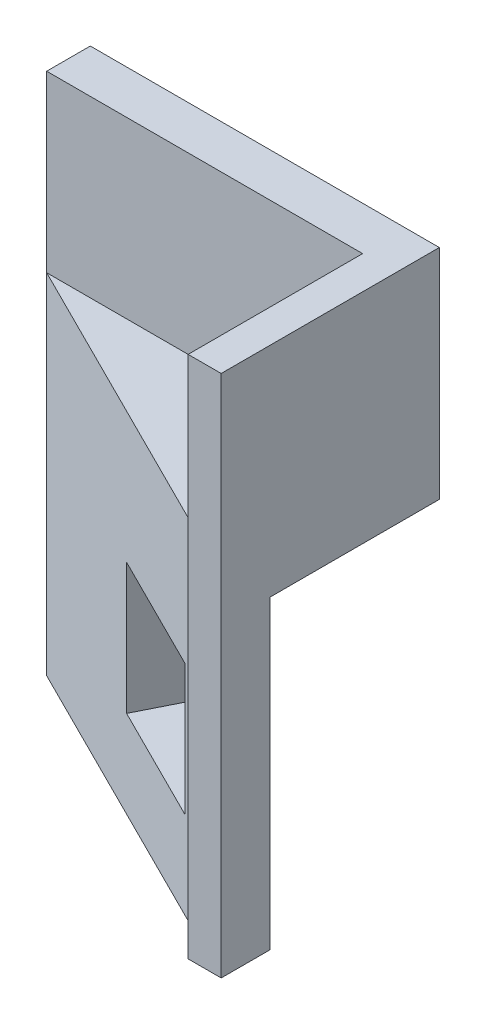
ISO-10303-21;
HEADER;
FILE_DESCRIPTION(('STEP AP214'),'2;1');
FILE_NAME('part.step','',(''),(''),'','','');
FILE_SCHEMA(('AUTOMOTIVE_DESIGN { 1 0 10303 214 1 1 1 1 }'));
ENDSEC;
DATA;
#1=APPLICATION_CONTEXT('core data for automotive mechanical design processes');
#2=APPLICATION_PROTOCOL_DEFINITION('international standard','automotive_design',2000,#1);
#3=PRODUCT_CONTEXT('',#1,'mechanical');
#4=PRODUCT('Part','Part','',(#3));
#5=PRODUCT_RELATED_PRODUCT_CATEGORY('part','',(#4));
#6=PRODUCT_DEFINITION_FORMATION('','',#4);
#7=PRODUCT_DEFINITION_CONTEXT('part definition',#1,'design');
#8=PRODUCT_DEFINITION('design','',#6,#7);
#9=PRODUCT_DEFINITION_SHAPE('','',#8);
#10=(LENGTH_UNIT() NAMED_UNIT(*) SI_UNIT(.MILLI.,.METRE.));
#11=(NAMED_UNIT(*) PLANE_ANGLE_UNIT() SI_UNIT($,.RADIAN.));
#12=(NAMED_UNIT(*) SI_UNIT($,.STERADIAN.) SOLID_ANGLE_UNIT());
#13=UNCERTAINTY_MEASURE_WITH_UNIT(LENGTH_MEASURE(1.E-05),#10,'distance_accuracy_value','');
#14=(GEOMETRIC_REPRESENTATION_CONTEXT(3) GLOBAL_UNCERTAINTY_ASSIGNED_CONTEXT((#13)) GLOBAL_UNIT_ASSIGNED_CONTEXT((#10,
#11,#12)) REPRESENTATION_CONTEXT('',''));
#15=CARTESIAN_POINT('',(0.,0.,0.));
#16=DIRECTION('',(0.,0.,1.));
#17=DIRECTION('',(1.,0.,0.));
#18=AXIS2_PLACEMENT_3D('',#15,#16,#17);
#19=CARTESIAN_POINT('',(0.,0.,6.35));
#20=DIRECTION('',(1.,0.,0.));
#21=DIRECTION('',(0.,1.,0.));
#22=AXIS2_PLACEMENT_3D('',#19,#20,#21);
#23=PLANE('',#22);
#24=DIRECTION('',(0.,0.,-1.));
#25=VECTOR('',#24,1.);
#26=CARTESIAN_POINT('',(0.,-76.2,6.35));
#27=LINE('',#26,#25);
#28=CARTESIAN_POINT('',(0.,-76.2,6.35));
#29=VERTEX_POINT('',#28);
#30=CARTESIAN_POINT('',(0.,-76.2,0.));
#31=VERTEX_POINT('',#30);
#32=EDGE_CURVE('E44',#29,#31,#27,.T.);
#33=ORIENTED_EDGE('',*,*,#32,.F.);
#34=DIRECTION('',(0.,1.,0.));
#35=VECTOR('',#34,1.);
#36=CARTESIAN_POINT('',(0.,-76.201,6.35));
#37=LINE('',#36,#35);
#38=CARTESIAN_POINT('',(0.,-25.4,6.35));
#39=VERTEX_POINT('',#38);
#40=EDGE_CURVE('E221',#29,#39,#37,.T.);
#41=ORIENTED_EDGE('',*,*,#40,.T.);
#42=DIRECTION('',(0.,-1.,0.));
#43=VECTOR('',#42,1.);
#44=CARTESIAN_POINT('',(0.,0.,6.35));
#45=LINE('',#44,#43);
#46=CARTESIAN_POINT('',(0.,0.,6.35));
#47=VERTEX_POINT('',#46);
#48=EDGE_CURVE('E215',#47,#39,#45,.T.);
#49=ORIENTED_EDGE('',*,*,#48,.F.);
#50=DIRECTION('',(0.,0.,-1.));
#51=VECTOR('',#50,1.);
#52=CARTESIAN_POINT('',(0.,0.,6.35));
#53=LINE('',#52,#51);
#54=CARTESIAN_POINT('',(0.,0.,0.));
#55=VERTEX_POINT('',#54);
#56=EDGE_CURVE('E247',#47,#55,#53,.T.);
#57=ORIENTED_EDGE('',*,*,#56,.T.);
#58=DIRECTION('',(0.,-1.,0.));
#59=VECTOR('',#58,1.);
#60=CARTESIAN_POINT('',(0.,0.,0.));
#61=LINE('',#60,#59);
#62=EDGE_CURVE('E207',#55,#31,#61,.T.);
#63=ORIENTED_EDGE('',*,*,#62,.T.);
#64=EDGE_LOOP('',(#33,#41,#49,#57,#63));
#65=FACE_BOUND('',#64,.T.);
#66=ADVANCED_FACE('F35',(#65),#23,.F.);
#67=CARTESIAN_POINT('',(0.,-76.2,6.35));
#68=DIRECTION('',(0.,1.,0.));
#69=DIRECTION('',(0.,0.,1.));
#70=AXIS2_PLACEMENT_3D('',#67,#68,#69);
#71=PLANE('',#70);
#72=DIRECTION('',(1.,0.,0.));
#73=VECTOR('',#72,1.);
#74=CARTESIAN_POINT('',(0.,-76.2,0.));
#75=LINE('',#74,#73);
#76=CARTESIAN_POINT('',(1.4990316571237,-76.2,0.));
#77=VERTEX_POINT('',#76);
#78=EDGE_CURVE('E267',#31,#77,#75,.T.);
#79=ORIENTED_EDGE('',*,*,#78,.T.);
#80=DIRECTION('',(-0.894427190999916,0.,-0.447213595499958));
#81=VECTOR('',#80,1.);
#82=CARTESIAN_POINT('',(50.8,-76.2,24.6504841714382));
#83=LINE('',#82,#81);
#84=CARTESIAN_POINT('',(50.8,-76.2,24.6504841714382));
#85=VERTEX_POINT('',#84);
#86=EDGE_CURVE('E147',#85,#77,#83,.T.);
#87=ORIENTED_EDGE('',*,*,#86,.F.);
#88=DIRECTION('',(0.,0.,-1.));
#89=VECTOR('',#88,1.);
#90=CARTESIAN_POINT('',(50.8,-76.2,6.35));
#91=LINE('',#90,#89);
#92=CARTESIAN_POINT('',(50.8,-76.2,31.75));
#93=VERTEX_POINT('',#92);
#94=EDGE_CURVE('E254',#93,#85,#91,.T.);
#95=ORIENTED_EDGE('',*,*,#94,.F.);
#96=DIRECTION('',(-1.,0.,0.));
#97=VECTOR('',#96,1.);
#98=CARTESIAN_POINT('',(50.8,-76.2,31.75));
#99=LINE('',#98,#97);
#100=CARTESIAN_POINT('',(45.9862967894864,-76.2,31.75));
#101=VERTEX_POINT('',#100);
#102=EDGE_CURVE('E181',#93,#101,#99,.T.);
#103=ORIENTED_EDGE('',*,*,#102,.T.);
#104=DIRECTION('',(0.,0.,-1.));
#105=VECTOR('',#104,1.);
#106=CARTESIAN_POINT('',(45.9862967894864,-76.2,31.75));
#107=LINE('',#106,#105);
#108=CARTESIAN_POINT('',(45.9862967894864,-76.2,29.3431483947432));
#109=VERTEX_POINT('',#108);
#110=EDGE_CURVE('E191',#101,#109,#107,.T.);
#111=ORIENTED_EDGE('',*,*,#110,.T.);
#112=DIRECTION('',(0.894427190999916,0.,0.447213595499958));
#113=VECTOR('',#112,1.);
#114=CARTESIAN_POINT('',(50.8,-76.2,31.75));
#115=LINE('',#114,#113);
#116=EDGE_CURVE('E202',#29,#109,#115,.T.);
#117=ORIENTED_EDGE('',*,*,#116,.F.);
#118=ORIENTED_EDGE('',*,*,#32,.T.);
#119=EDGE_LOOP('',(#79,#87,#95,#103,#111,#117,#118));
#120=FACE_BOUND('',#119,.T.);
#121=ADVANCED_FACE('F265',(#120),#71,.F.);
#122=CARTESIAN_POINT('',(50.8,0.,6.35));
#123=DIRECTION('',(-1.,0.,0.));
#124=DIRECTION('',(0.,-1.,0.));
#125=AXIS2_PLACEMENT_3D('',#122,#123,#124);
#126=PLANE('',#125);
#127=ORIENTED_EDGE('',*,*,#94,.T.);
#128=DIRECTION('',(0.,-1.,0.));
#129=VECTOR('',#128,1.);
#130=CARTESIAN_POINT('',(50.8,-31.75,24.6504841714382));
#131=LINE('',#130,#129);
#132=CARTESIAN_POINT('',(50.8,-31.75,24.6504841714382));
#133=VERTEX_POINT('',#132);
#134=EDGE_CURVE('E176',#133,#85,#131,.T.);
#135=ORIENTED_EDGE('',*,*,#134,.F.);
#136=DIRECTION('',(0.,0.,1.));
#137=VECTOR('',#136,1.);
#138=CARTESIAN_POINT('',(50.8,-31.75,0.));
#139=LINE('',#138,#137);
#140=CARTESIAN_POINT('',(50.8,-31.75,0.));
#141=VERTEX_POINT('',#140);
#142=EDGE_CURVE('E172',#141,#133,#139,.T.);
#143=ORIENTED_EDGE('',*,*,#142,.F.);
#144=DIRECTION('',(0.,1.,0.));
#145=VECTOR('',#144,1.);
#146=CARTESIAN_POINT('',(50.8,0.,0.));
#147=LINE('',#146,#145);
#148=CARTESIAN_POINT('',(50.8,0.,0.));
#149=VERTEX_POINT('',#148);
#150=EDGE_CURVE('E272',#141,#149,#147,.T.);
#151=ORIENTED_EDGE('',*,*,#150,.T.);
#152=DIRECTION('',(0.,0.,-1.));
#153=VECTOR('',#152,1.);
#154=CARTESIAN_POINT('',(50.8,0.,6.35));
#155=LINE('',#154,#153);
#156=CARTESIAN_POINT('',(50.8,0.,31.75));
#157=VERTEX_POINT('',#156);
#158=EDGE_CURVE('E252',#157,#149,#155,.T.);
#159=ORIENTED_EDGE('',*,*,#158,.F.);
#160=DIRECTION('',(0.,1.,0.));
#161=VECTOR('',#160,1.);
#162=CARTESIAN_POINT('',(50.8,-76.2,31.75));
#163=LINE('',#162,#161);
#164=EDGE_CURVE('E205',#93,#157,#163,.T.);
#165=ORIENTED_EDGE('',*,*,#164,.F.);
#166=EDGE_LOOP('',(#127,#135,#143,#151,#159,#165));
#167=FACE_BOUND('',#166,.T.);
#168=ADVANCED_FACE('F276',(#167),#126,.F.);
#169=CARTESIAN_POINT('',(0.,0.,6.35));
#170=DIRECTION('',(0.,-1.,0.));
#171=DIRECTION('',(0.,0.,-1.));
#172=AXIS2_PLACEMENT_3D('',#169,#170,#171);
#173=PLANE('',#172);
#174=DIRECTION('',(-1.,0.,0.));
#175=VECTOR('',#174,1.);
#176=CARTESIAN_POINT('',(0.,0.,6.35));
#177=LINE('',#176,#175);
#178=CARTESIAN_POINT('',(45.9862967894864,0.,6.35));
#179=VERTEX_POINT('',#178);
#180=EDGE_CURVE('E212',#179,#47,#177,.T.);
#181=ORIENTED_EDGE('',*,*,#180,.F.);
#182=DIRECTION('',(0.,0.,-1.));
#183=VECTOR('',#182,1.);
#184=CARTESIAN_POINT('',(45.9862967894864,0.,31.75));
#185=LINE('',#184,#183);
#186=CARTESIAN_POINT('',(45.9862967894864,0.,31.75));
#187=VERTEX_POINT('',#186);
#188=EDGE_CURVE('E192',#187,#179,#185,.T.);
#189=ORIENTED_EDGE('',*,*,#188,.F.);
#190=DIRECTION('',(1.,0.,0.));
#191=VECTOR('',#190,1.);
#192=CARTESIAN_POINT('',(50.8,0.,31.75));
#193=LINE('',#192,#191);
#194=EDGE_CURVE('E188',#187,#157,#193,.T.);
#195=ORIENTED_EDGE('',*,*,#194,.T.);
#196=ORIENTED_EDGE('',*,*,#158,.T.);
#197=DIRECTION('',(-1.,0.,0.));
#198=VECTOR('',#197,1.);
#199=CARTESIAN_POINT('',(0.,0.,0.));
#200=LINE('',#199,#198);
#201=EDGE_CURVE('E219',#149,#55,#200,.T.);
#202=ORIENTED_EDGE('',*,*,#201,.T.);
#203=ORIENTED_EDGE('',*,*,#56,.F.);
#204=EDGE_LOOP('',(#181,#189,#195,#196,#202,#203));
#205=FACE_BOUND('',#204,.T.);
#206=ADVANCED_FACE('F248',(#205),#173,.F.);
#207=CARTESIAN_POINT('',(0.,0.,6.35));
#208=DIRECTION('',(0.,0.,1.));
#209=DIRECTION('',(1.,0.,0.));
#210=AXIS2_PLACEMENT_3D('',#207,#208,#209);
#211=PLANE('',#210);
#212=DIRECTION('',(0.,-1.,0.));
#213=VECTOR('',#212,1.);
#214=CARTESIAN_POINT('',(45.9862967894864,0.,6.35));
#215=LINE('',#214,#213);
#216=CARTESIAN_POINT('',(45.9862967894864,-25.4,6.35));
#217=VERTEX_POINT('',#216);
#218=EDGE_CURVE('E199',#179,#217,#215,.T.);
#219=ORIENTED_EDGE('',*,*,#218,.F.);
#220=ORIENTED_EDGE('',*,*,#180,.T.);
#221=ORIENTED_EDGE('',*,*,#48,.T.);
#222=DIRECTION('',(-1.,0.,0.));
#223=VECTOR('',#222,1.);
#224=CARTESIAN_POINT('',(0.,-25.4,6.35));
#225=LINE('',#224,#223);
#226=EDGE_CURVE('E38',#217,#39,#225,.T.);
#227=ORIENTED_EDGE('',*,*,#226,.F.);
#228=EDGE_LOOP('',(#219,#220,#221,#227));
#229=FACE_BOUND('',#228,.T.);
#230=ADVANCED_FACE('F243',(#229),#211,.T.);
#231=CARTESIAN_POINT('',(0.,0.,0.));
#232=DIRECTION('',(0.,0.,1.));
#233=DIRECTION('',(1.,0.,0.));
#234=AXIS2_PLACEMENT_3D('',#231,#232,#233);
#235=PLANE('',#234);
#236=DIRECTION('',(1.,0.,0.));
#237=VECTOR('',#236,1.);
#238=CARTESIAN_POINT('',(1.4990316571237,-31.75,0.));
#239=LINE('',#238,#237);
#240=CARTESIAN_POINT('',(1.4990316571237,-31.75,0.));
#241=VERTEX_POINT('',#240);
#242=EDGE_CURVE('E170',#241,#141,#239,.T.);
#243=ORIENTED_EDGE('',*,*,#242,.F.);
#244=DIRECTION('',(0.,-1.,0.));
#245=VECTOR('',#244,1.);
#246=CARTESIAN_POINT('',(1.4990316571237,-31.75,0.));
#247=LINE('',#246,#245);
#248=EDGE_CURVE('E178',#241,#77,#247,.T.);
#249=ORIENTED_EDGE('',*,*,#248,.T.);
#250=ORIENTED_EDGE('',*,*,#78,.F.);
#251=ORIENTED_EDGE('',*,*,#62,.F.);
#252=ORIENTED_EDGE('',*,*,#201,.F.);
#253=ORIENTED_EDGE('',*,*,#150,.F.);
#254=EDGE_LOOP('',(#243,#249,#250,#251,#252,#253));
#255=FACE_BOUND('',#254,.T.);
#256=ADVANCED_FACE('F270',(#255),#235,.F.);
#257=CARTESIAN_POINT('',(0.,-25.4,31.75));
#258=DIRECTION('',(0.,-1.,0.));
#259=DIRECTION('',(0.,0.,-1.));
#260=AXIS2_PLACEMENT_3D('',#257,#258,#259);
#261=PLANE('',#260);
#262=DIRECTION('',(-0.894427190999916,0.,-0.447213595499958));
#263=VECTOR('',#262,1.);
#264=CARTESIAN_POINT('',(50.8,-25.4,31.75));
#265=LINE('',#264,#263);
#266=CARTESIAN_POINT('',(45.9862967894864,-25.4,29.3431483947432));
#267=VERTEX_POINT('',#266);
#268=EDGE_CURVE('E204',#267,#39,#265,.T.);
#269=ORIENTED_EDGE('',*,*,#268,.F.);
#270=DIRECTION('',(0.,0.,-1.));
#271=VECTOR('',#270,1.);
#272=CARTESIAN_POINT('',(45.9862967894864,-25.4,31.75));
#273=LINE('',#272,#271);
#274=EDGE_CURVE('E195',#267,#217,#273,.T.);
#275=ORIENTED_EDGE('',*,*,#274,.T.);
#276=ORIENTED_EDGE('',*,*,#226,.T.);
#277=EDGE_LOOP('',(#269,#275,#276));
#278=FACE_BOUND('',#277,.T.);
#279=ADVANCED_FACE('F307',(#278),#261,.F.);
#280=CARTESIAN_POINT('',(50.8,-76.201,31.75));
#281=DIRECTION('',(0.447213595499958,0.,-0.894427190999916));
#282=DIRECTION('',(-0.894427190999916,0.,-0.447213595499958));
#283=AXIS2_PLACEMENT_3D('',#280,#281,#282);
#284=PLANE('',#283);
#285=DIRECTION('',(0.894427190999916,0.,0.447213595499958));
#286=VECTOR('',#285,1.);
#287=CARTESIAN_POINT('',(23.2678461380885,-63.5,17.9839230690443));
#288=LINE('',#287,#286);
#289=CARTESIAN_POINT('',(23.2678461380885,-63.5,17.9839230690443));
#290=VERTEX_POINT('',#289);
#291=CARTESIAN_POINT('',(40.3066841266369,-63.5,26.5033420633185));
#292=VERTEX_POINT('',#291);
#293=EDGE_CURVE('E155',#290,#292,#288,.T.);
#294=ORIENTED_EDGE('',*,*,#293,.F.);
#295=DIRECTION('',(0.,-1.,0.));
#296=VECTOR('',#295,1.);
#297=CARTESIAN_POINT('',(23.2678461380885,-44.45,17.9839230690443));
#298=LINE('',#297,#296);
#299=CARTESIAN_POINT('',(23.2678461380885,-44.45,17.9839230690443));
#300=VERTEX_POINT('',#299);
#301=EDGE_CURVE('E51',#300,#290,#298,.T.);
#302=ORIENTED_EDGE('',*,*,#301,.F.);
#303=DIRECTION('',(-0.894427190999916,0.,-0.447213595499958));
#304=VECTOR('',#303,1.);
#305=CARTESIAN_POINT('',(23.2678461380885,-44.45,17.9839230690443));
#306=LINE('',#305,#304);
#307=CARTESIAN_POINT('',(40.3066841266369,-44.45,26.5033420633185));
#308=VERTEX_POINT('',#307);
#309=EDGE_CURVE('E141',#308,#300,#306,.T.);
#310=ORIENTED_EDGE('',*,*,#309,.F.);
#311=DIRECTION('',(0.,1.,0.));
#312=VECTOR('',#311,1.);
#313=CARTESIAN_POINT('',(40.3066841266369,-44.45,26.5033420633185));
#314=LINE('',#313,#312);
#315=EDGE_CURVE('E161',#292,#308,#314,.T.);
#316=ORIENTED_EDGE('',*,*,#315,.F.);
#317=EDGE_LOOP('',(#294,#302,#310,#316));
#318=FACE_BOUND('',#317,.T.);
#319=ORIENTED_EDGE('',*,*,#116,.T.);
#320=DIRECTION('',(0.,1.,0.));
#321=VECTOR('',#320,1.);
#322=CARTESIAN_POINT('',(45.9862967894864,-76.201,29.3431483947432));
#323=LINE('',#322,#321);
#324=EDGE_CURVE('E11',#109,#267,#323,.T.);
#325=ORIENTED_EDGE('',*,*,#324,.T.);
#326=ORIENTED_EDGE('',*,*,#268,.T.);
#327=ORIENTED_EDGE('',*,*,#40,.F.);
#328=EDGE_LOOP('',(#319,#325,#326,#327));
#329=FACE_BOUND('',#328,.T.);
#330=ADVANCED_FACE('F231',(#318,#329),#284,.F.);
#331=CARTESIAN_POINT('',(45.9862967894864,0.,31.75));
#332=DIRECTION('',(-1.,0.,0.));
#333=DIRECTION('',(0.,0.,1.));
#334=AXIS2_PLACEMENT_3D('',#331,#332,#333);
#335=PLANE('',#334);
#336=ORIENTED_EDGE('',*,*,#188,.T.);
#337=ORIENTED_EDGE('',*,*,#218,.T.);
#338=ORIENTED_EDGE('',*,*,#274,.F.);
#339=ORIENTED_EDGE('',*,*,#324,.F.);
#340=ORIENTED_EDGE('',*,*,#110,.F.);
#341=DIRECTION('',(0.,1.,0.));
#342=VECTOR('',#341,1.);
#343=CARTESIAN_POINT('',(45.9862967894864,0.,31.75));
#344=LINE('',#343,#342);
#345=EDGE_CURVE('E185',#101,#187,#344,.T.);
#346=ORIENTED_EDGE('',*,*,#345,.T.);
#347=EDGE_LOOP('',(#336,#337,#338,#339,#340,#346));
#348=FACE_BOUND('',#347,.T.);
#349=ADVANCED_FACE('F314',(#348),#335,.T.);
#350=CARTESIAN_POINT('',(0.,0.,31.75));
#351=DIRECTION('',(0.,0.,-1.));
#352=DIRECTION('',(-1.,0.,0.));
#353=AXIS2_PLACEMENT_3D('',#350,#351,#352);
#354=PLANE('',#353);
#355=ORIENTED_EDGE('',*,*,#164,.T.);
#356=ORIENTED_EDGE('',*,*,#194,.F.);
#357=ORIENTED_EDGE('',*,*,#345,.F.);
#358=ORIENTED_EDGE('',*,*,#102,.F.);
#359=EDGE_LOOP('',(#355,#356,#357,#358));
#360=FACE_BOUND('',#359,.T.);
#361=ADVANCED_FACE('F280',(#360),#354,.F.);
#362=CARTESIAN_POINT('',(50.8,-31.75,24.6504841714382));
#363=DIRECTION('',(-0.447213595499958,0.,0.894427190999916));
#364=DIRECTION('',(0.894427190999916,0.,0.447213595499958));
#365=AXIS2_PLACEMENT_3D('',#362,#363,#364);
#366=PLANE('',#365);
#367=DIRECTION('',(0.894427190999916,0.,0.447213595499958));
#368=VECTOR('',#367,1.);
#369=CARTESIAN_POINT('',(26.1076524695133,-44.45,12.3043104061948));
#370=LINE('',#369,#368);
#371=CARTESIAN_POINT('',(26.1076524695133,-44.45,12.3043104061948));
#372=VERTEX_POINT('',#371);
#373=CARTESIAN_POINT('',(43.1464904580617,-44.45,20.823729400469));
#374=VERTEX_POINT('',#373);
#375=EDGE_CURVE('E153',#372,#374,#370,.T.);
#376=ORIENTED_EDGE('',*,*,#375,.F.);
#377=DIRECTION('',(0.,1.,0.));
#378=VECTOR('',#377,1.);
#379=CARTESIAN_POINT('',(26.1076524695133,-44.45,12.3043104061948));
#380=LINE('',#379,#378);
#381=CARTESIAN_POINT('',(26.1076524695133,-63.5,12.3043104061948));
#382=VERTEX_POINT('',#381);
#383=EDGE_CURVE('E135',#382,#372,#380,.T.);
#384=ORIENTED_EDGE('',*,*,#383,.F.);
#385=DIRECTION('',(-0.894427190999916,0.,-0.447213595499958));
#386=VECTOR('',#385,1.);
#387=CARTESIAN_POINT('',(26.1076524695133,-63.5,12.3043104061948));
#388=LINE('',#387,#386);
#389=CARTESIAN_POINT('',(43.1464904580617,-63.5,20.823729400469));
#390=VERTEX_POINT('',#389);
#391=EDGE_CURVE('E144',#390,#382,#388,.T.);
#392=ORIENTED_EDGE('',*,*,#391,.F.);
#393=DIRECTION('',(0.,-1.,0.));
#394=VECTOR('',#393,1.);
#395=CARTESIAN_POINT('',(43.1464904580617,-44.45,20.823729400469));
#396=LINE('',#395,#394);
#397=EDGE_CURVE('E59',#374,#390,#396,.T.);
#398=ORIENTED_EDGE('',*,*,#397,.F.);
#399=EDGE_LOOP('',(#376,#384,#392,#398));
#400=FACE_BOUND('',#399,.T.);
#401=ORIENTED_EDGE('',*,*,#86,.T.);
#402=ORIENTED_EDGE('',*,*,#248,.F.);
#403=DIRECTION('',(-0.894427190999916,0.,-0.447213595499958));
#404=VECTOR('',#403,1.);
#405=CARTESIAN_POINT('',(50.8,-31.75,24.6504841714382));
#406=LINE('',#405,#404);
#407=EDGE_CURVE('E174',#133,#241,#406,.T.);
#408=ORIENTED_EDGE('',*,*,#407,.F.);
#409=ORIENTED_EDGE('',*,*,#134,.T.);
#410=EDGE_LOOP('',(#401,#402,#408,#409));
#411=FACE_BOUND('',#410,.T.);
#412=ADVANCED_FACE('F150',(#400,#411),#366,.F.);
#413=CARTESIAN_POINT('',(0.,-31.75,0.));
#414=DIRECTION('',(0.,-1.,0.));
#415=DIRECTION('',(0.,0.,-1.));
#416=AXIS2_PLACEMENT_3D('',#413,#414,#415);
#417=PLANE('',#416);
#418=ORIENTED_EDGE('',*,*,#242,.T.);
#419=ORIENTED_EDGE('',*,*,#142,.T.);
#420=ORIENTED_EDGE('',*,*,#407,.T.);
#421=EDGE_LOOP('',(#418,#419,#420));
#422=FACE_BOUND('',#421,.T.);
#423=ADVANCED_FACE('F284',(#422),#417,.T.);
#424=CARTESIAN_POINT('',(35.9684461380885,-44.45,-7.41727693095574));
#425=DIRECTION('',(-0.894427190999916,0.,-0.447213595499958));
#426=DIRECTION('',(-0.447213595499958,0.,0.894427190999916));
#427=AXIS2_PLACEMENT_3D('',#424,#425,#426);
#428=PLANE('',#427);
#429=ORIENTED_EDGE('',*,*,#383,.T.);
#430=DIRECTION('',(-0.447213595499958,0.,0.894427190999916));
#431=VECTOR('',#430,1.);
#432=CARTESIAN_POINT('',(35.9684461380885,-44.45,-7.41727693095574));
#433=LINE('',#432,#431);
#434=EDGE_CURVE('E148',#372,#300,#433,.T.);
#435=ORIENTED_EDGE('',*,*,#434,.T.);
#436=ORIENTED_EDGE('',*,*,#301,.T.);
#437=DIRECTION('',(-0.447213595499958,0.,0.894427190999916));
#438=VECTOR('',#437,1.);
#439=CARTESIAN_POINT('',(35.9684461380886,-63.5,-7.41727693095573));
#440=LINE('',#439,#438);
#441=EDGE_CURVE('E131',#382,#290,#440,.T.);
#442=ORIENTED_EDGE('',*,*,#441,.F.);
#443=EDGE_LOOP('',(#429,#435,#436,#442));
#444=FACE_BOUND('',#443,.T.);
#445=ADVANCED_FACE('F133',(#444),#428,.F.);
#446=CARTESIAN_POINT('',(35.9684461380885,-44.45,-7.41727693095574));
#447=DIRECTION('',(0.,1.,0.));
#448=DIRECTION('',(0.,0.,1.));
#449=AXIS2_PLACEMENT_3D('',#446,#447,#448);
#450=PLANE('',#449);
#451=ORIENTED_EDGE('',*,*,#375,.T.);
#452=DIRECTION('',(-0.447213595499958,0.,0.894427190999916));
#453=VECTOR('',#452,1.);
#454=CARTESIAN_POINT('',(53.0072841266369,-44.45,1.10214206331847));
#455=LINE('',#454,#453);
#456=EDGE_CURVE('E167',#374,#308,#455,.T.);
#457=ORIENTED_EDGE('',*,*,#456,.T.);
#458=ORIENTED_EDGE('',*,*,#309,.T.);
#459=ORIENTED_EDGE('',*,*,#434,.F.);
#460=EDGE_LOOP('',(#451,#457,#458,#459));
#461=FACE_BOUND('',#460,.T.);
#462=ADVANCED_FACE('F291',(#461),#450,.F.);
#463=CARTESIAN_POINT('',(53.0072841266369,-44.45,1.10214206331847));
#464=DIRECTION('',(0.894427190999916,0.,0.447213595499958));
#465=DIRECTION('',(0.447213595499958,0.,-0.894427190999916));
#466=AXIS2_PLACEMENT_3D('',#463,#464,#465);
#467=PLANE('',#466);
#468=ORIENTED_EDGE('',*,*,#397,.T.);
#469=DIRECTION('',(-0.447213595499958,0.,0.894427190999916));
#470=VECTOR('',#469,1.);
#471=CARTESIAN_POINT('',(53.0072841266369,-63.5,1.10214206331847));
#472=LINE('',#471,#470);
#473=EDGE_CURVE('E140',#390,#292,#472,.T.);
#474=ORIENTED_EDGE('',*,*,#473,.T.);
#475=ORIENTED_EDGE('',*,*,#315,.T.);
#476=ORIENTED_EDGE('',*,*,#456,.F.);
#477=EDGE_LOOP('',(#468,#474,#475,#476));
#478=FACE_BOUND('',#477,.T.);
#479=ADVANCED_FACE('F347',(#478),#467,.F.);
#480=CARTESIAN_POINT('',(35.9684461380886,-63.5,-7.41727693095573));
#481=DIRECTION('',(0.,-1.,0.));
#482=DIRECTION('',(0.,0.,-1.));
#483=AXIS2_PLACEMENT_3D('',#480,#481,#482);
#484=PLANE('',#483);
#485=ORIENTED_EDGE('',*,*,#391,.T.);
#486=ORIENTED_EDGE('',*,*,#441,.T.);
#487=ORIENTED_EDGE('',*,*,#293,.T.);
#488=ORIENTED_EDGE('',*,*,#473,.F.);
#489=EDGE_LOOP('',(#485,#486,#487,#488));
#490=FACE_BOUND('',#489,.T.);
#491=ADVANCED_FACE('F145',(#490),#484,.F.);
#492=CLOSED_SHELL('',(#66,#121,#168,#206,#230,#256,#279,#330,#349,#361,#412,#423,#445,#462,#479,#491));
#493=MANIFOLD_SOLID_BREP('B2',#492);
#494=ADVANCED_BREP_SHAPE_REPRESENTATION('',(#18,#493),#14);
#495=SHAPE_DEFINITION_REPRESENTATION(#9,#494);
ENDSEC;
END-ISO-10303-21;
